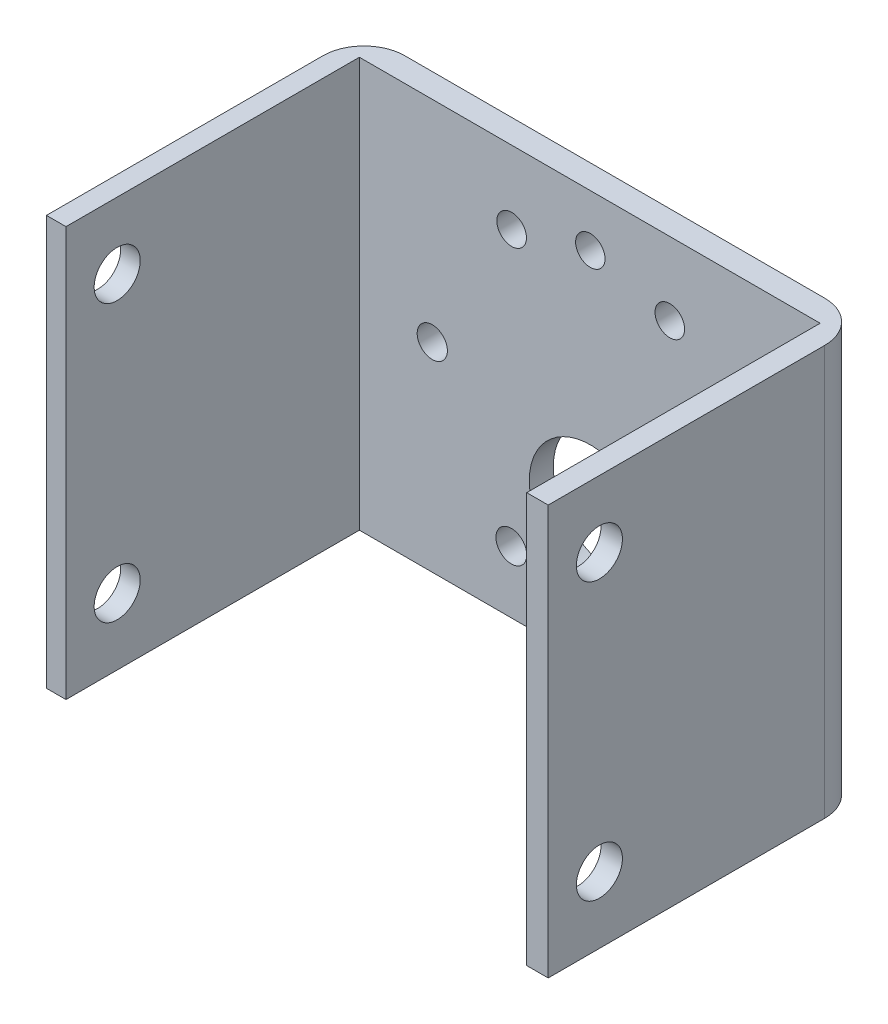
ISO-10303-21;
HEADER;
FILE_DESCRIPTION(('STEP AP214'),'2;1');
FILE_NAME('part.step','',(''),(''),'','','');
FILE_SCHEMA(('AUTOMOTIVE_DESIGN { 1 0 10303 214 1 1 1 1 }'));
ENDSEC;
DATA;
#1=APPLICATION_CONTEXT('core data for automotive mechanical design processes');
#2=APPLICATION_PROTOCOL_DEFINITION('international standard','automotive_design',2000,#1);
#3=PRODUCT_CONTEXT('',#1,'mechanical');
#4=PRODUCT('Part','Part','',(#3));
#5=PRODUCT_RELATED_PRODUCT_CATEGORY('part','',(#4));
#6=PRODUCT_DEFINITION_FORMATION('','',#4);
#7=PRODUCT_DEFINITION_CONTEXT('part definition',#1,'design');
#8=PRODUCT_DEFINITION('design','',#6,#7);
#9=PRODUCT_DEFINITION_SHAPE('','',#8);
#10=(LENGTH_UNIT() NAMED_UNIT(*) SI_UNIT(.MILLI.,.METRE.));
#11=(NAMED_UNIT(*) PLANE_ANGLE_UNIT() SI_UNIT($,.RADIAN.));
#12=(NAMED_UNIT(*) SI_UNIT($,.STERADIAN.) SOLID_ANGLE_UNIT());
#13=UNCERTAINTY_MEASURE_WITH_UNIT(LENGTH_MEASURE(1.E-05),#10,'distance_accuracy_value','');
#14=(GEOMETRIC_REPRESENTATION_CONTEXT(3) GLOBAL_UNCERTAINTY_ASSIGNED_CONTEXT((#13)) GLOBAL_UNIT_ASSIGNED_CONTEXT((#10,
#11,#12)) REPRESENTATION_CONTEXT('',''));
#15=CARTESIAN_POINT('',(0.,0.,0.));
#16=DIRECTION('',(0.,0.,1.));
#17=DIRECTION('',(1.,0.,0.));
#18=AXIS2_PLACEMENT_3D('',#15,#16,#17);
#19=CARTESIAN_POINT('',(22.2141703778084,40.,15.5));
#20=DIRECTION('',(0.,0.,-1.));
#21=DIRECTION('',(-1.,0.,0.));
#22=AXIS2_PLACEMENT_3D('',#19,#20,#21);
#23=PLANE('',#22);
#24=DIRECTION('',(1.,0.,0.));
#25=VECTOR('',#24,1.);
#26=CARTESIAN_POINT('',(22.2141703778084,40.,15.5));
#27=LINE('',#26,#25);
#28=CARTESIAN_POINT('',(22.4041703778084,40.,15.5));
#29=VERTEX_POINT('',#28);
#30=CARTESIAN_POINT('',(24.5,40.,15.5));
#31=VERTEX_POINT('',#30);
#32=EDGE_CURVE('E124',#29,#31,#27,.T.);
#33=ORIENTED_EDGE('',*,*,#32,.F.);
#34=DIRECTION('',(0.,-1.,0.));
#35=VECTOR('',#34,1.);
#36=CARTESIAN_POINT('',(22.4041703778084,463.,15.5));
#37=LINE('',#36,#35);
#38=CARTESIAN_POINT('',(22.4041703778084,0.,15.5));
#39=VERTEX_POINT('',#38);
#40=EDGE_CURVE('E134',#29,#39,#37,.T.);
#41=ORIENTED_EDGE('',*,*,#40,.T.);
#42=DIRECTION('',(1.,0.,0.));
#43=VECTOR('',#42,1.);
#44=CARTESIAN_POINT('',(22.2141703778084,0.,15.5));
#45=LINE('',#44,#43);
#46=CARTESIAN_POINT('',(24.5,0.,15.5));
#47=VERTEX_POINT('',#46);
#48=EDGE_CURVE('E139',#39,#47,#45,.T.);
#49=ORIENTED_EDGE('',*,*,#48,.T.);
#50=DIRECTION('',(0.,-1.,0.));
#51=VECTOR('',#50,1.);
#52=CARTESIAN_POINT('',(24.5,40.,15.5));
#53=LINE('',#52,#51);
#54=EDGE_CURVE('E202',#31,#47,#53,.T.);
#55=ORIENTED_EDGE('',*,*,#54,.F.);
#56=EDGE_LOOP('',(#33,#41,#49,#55));
#57=FACE_BOUND('',#56,.T.);
#58=ADVANCED_FACE('F35',(#57),#23,.F.);
#59=CARTESIAN_POINT('',(24.5,40.,-15.5));
#60=DIRECTION('',(-1.,0.,0.));
#61=DIRECTION('',(0.,0.,1.));
#62=AXIS2_PLACEMENT_3D('',#59,#60,#61);
#63=PLANE('',#62);
#64=CARTESIAN_POINT('',(24.5,6.5,10.5));
#65=DIRECTION('',(-1.,0.,0.));
#66=DIRECTION('',(0.,0.,1.));
#67=AXIS2_PLACEMENT_3D('',#64,#65,#66);
#68=CIRCLE('',#67,2.25);
#69=CARTESIAN_POINT('',(24.5,6.5,12.75));
#70=VERTEX_POINT('',#69);
#71=EDGE_CURVE('E172',#70,#70,#68,.T.);
#72=ORIENTED_EDGE('',*,*,#71,.T.);
#73=EDGE_LOOP('',(#72));
#74=FACE_BOUND('',#73,.T.);
#75=CARTESIAN_POINT('',(24.5,33.5,10.5));
#76=DIRECTION('',(-1.,0.,0.));
#77=DIRECTION('',(0.,0.,1.));
#78=AXIS2_PLACEMENT_3D('',#75,#76,#77);
#79=CIRCLE('',#78,2.25);
#80=CARTESIAN_POINT('',(24.5,33.5,12.75));
#81=VERTEX_POINT('',#80);
#82=EDGE_CURVE('E167',#81,#81,#79,.T.);
#83=ORIENTED_EDGE('',*,*,#82,.T.);
#84=EDGE_LOOP('',(#83));
#85=FACE_BOUND('',#84,.T.);
#86=DIRECTION('',(0.,0.,-1.));
#87=VECTOR('',#86,1.);
#88=CARTESIAN_POINT('',(24.5,0.,-15.5));
#89=LINE('',#88,#87);
#90=CARTESIAN_POINT('',(24.5,0.,-11.5));
#91=VERTEX_POINT('',#90);
#92=EDGE_CURVE('E190',#47,#91,#89,.T.);
#93=ORIENTED_EDGE('',*,*,#92,.T.);
#94=DIRECTION('',(0.,-1.,0.));
#95=VECTOR('',#94,1.);
#96=CARTESIAN_POINT('',(24.5,40.,-11.5));
#97=LINE('',#96,#95);
#98=CARTESIAN_POINT('',(24.5,40.,-11.5));
#99=VERTEX_POINT('',#98);
#100=EDGE_CURVE('E214',#91,#99,#97,.F.);
#101=ORIENTED_EDGE('',*,*,#100,.T.);
#102=DIRECTION('',(0.,0.,-1.));
#103=VECTOR('',#102,1.);
#104=CARTESIAN_POINT('',(24.5,40.,-15.5));
#105=LINE('',#104,#103);
#106=EDGE_CURVE('E176',#31,#99,#105,.T.);
#107=ORIENTED_EDGE('',*,*,#106,.F.);
#108=ORIENTED_EDGE('',*,*,#54,.T.);
#109=EDGE_LOOP('',(#93,#101,#107,#108));
#110=FACE_BOUND('',#109,.T.);
#111=ADVANCED_FACE('F259',(#74,#85,#110),#63,.F.);
#112=CARTESIAN_POINT('',(-24.5,40.,-15.5));
#113=DIRECTION('',(0.,0.,1.));
#114=DIRECTION('',(1.,0.,0.));
#115=AXIS2_PLACEMENT_3D('',#112,#113,#114);
#116=PLANE('',#115);
#117=CARTESIAN_POINT('',(-15.4751976460516,19.465354549289,-15.5));
#118=DIRECTION('',(0.,0.,-1.));
#119=DIRECTION('',(-1.,0.,0.));
#120=AXIS2_PLACEMENT_3D('',#117,#118,#119);
#121=CIRCLE('',#120,1.47560441927066);
#122=CARTESIAN_POINT('',(-16.9508020653222,19.465354549289,-15.5));
#123=VERTEX_POINT('',#122);
#124=EDGE_CURVE('E228',#123,#123,#121,.T.);
#125=ORIENTED_EDGE('',*,*,#124,.F.);
#126=EDGE_LOOP('',(#125));
#127=FACE_BOUND('',#126,.T.);
#128=CARTESIAN_POINT('',(-7.72259205509794,32.8759218055574,-15.5));
#129=DIRECTION('',(0.,0.,-1.));
#130=DIRECTION('',(-1.,0.,0.));
#131=AXIS2_PLACEMENT_3D('',#128,#129,#130);
#132=CIRCLE('',#131,1.44518411019594);
#133=CARTESIAN_POINT('',(-9.16777616529388,32.8759218055574,-15.5));
#134=VERTEX_POINT('',#133);
#135=EDGE_CURVE('E376',#134,#134,#132,.T.);
#136=ORIENTED_EDGE('',*,*,#135,.F.);
#137=EDGE_LOOP('',(#136));
#138=FACE_BOUND('',#137,.T.);
#139=CARTESIAN_POINT('',(7.72259205509795,32.8759218055574,-15.5));
#140=DIRECTION('',(0.,0.,-1.));
#141=DIRECTION('',(-1.,0.,0.));
#142=AXIS2_PLACEMENT_3D('',#139,#140,#141);
#143=CIRCLE('',#142,1.44518411019594);
#144=CARTESIAN_POINT('',(6.27740794490201,32.8759218055574,-15.5));
#145=VERTEX_POINT('',#144);
#146=EDGE_CURVE('E373',#145,#145,#143,.T.);
#147=ORIENTED_EDGE('',*,*,#146,.F.);
#148=EDGE_LOOP('',(#147));
#149=FACE_BOUND('',#148,.T.);
#150=CARTESIAN_POINT('',(7.7526009269815,6.07211293079628,-15.5));
#151=DIRECTION('',(0.,0.,-1.));
#152=DIRECTION('',(-1.,0.,0.));
#153=AXIS2_PLACEMENT_3D('',#150,#151,#152);
#154=CIRCLE('',#153,1.5);
#155=CARTESIAN_POINT('',(6.2526009269815,6.07211293079628,-15.5));
#156=VERTEX_POINT('',#155);
#157=EDGE_CURVE('E369',#156,#156,#154,.T.);
#158=ORIENTED_EDGE('',*,*,#157,.F.);
#159=EDGE_LOOP('',(#158));
#160=FACE_BOUND('',#159,.T.);
#161=CARTESIAN_POINT('',(15.4751976460516,19.465354549289,-15.5));
#162=DIRECTION('',(0.,0.,-1.));
#163=DIRECTION('',(-1.,0.,0.));
#164=AXIS2_PLACEMENT_3D('',#161,#162,#163);
#165=CIRCLE('',#164,1.46320376411556);
#166=CARTESIAN_POINT('',(14.011993881936,19.465354549289,-15.5));
#167=VERTEX_POINT('',#166);
#168=EDGE_CURVE('E363',#167,#167,#165,.T.);
#169=ORIENTED_EDGE('',*,*,#168,.F.);
#170=EDGE_LOOP('',(#169));
#171=FACE_BOUND('',#170,.T.);
#172=CARTESIAN_POINT('',(0.,3.99015690323744,-15.5));
#173=DIRECTION('',(0.,0.,-1.));
#174=DIRECTION('',(-1.,0.,0.));
#175=AXIS2_PLACEMENT_3D('',#172,#173,#174);
#176=CIRCLE('',#175,1.5);
#177=CARTESIAN_POINT('',(-1.49999999999999,3.99015690323744,-15.5));
#178=VERTEX_POINT('',#177);
#179=EDGE_CURVE('E366',#178,#178,#176,.T.);
#180=ORIENTED_EDGE('',*,*,#179,.F.);
#181=EDGE_LOOP('',(#180));
#182=FACE_BOUND('',#181,.T.);
#183=CARTESIAN_POINT('',(-0.0421418164080409,34.9349375124211,-15.5));
#184=DIRECTION('',(0.,0.,-1.));
#185=DIRECTION('',(-1.,0.,0.));
#186=AXIS2_PLACEMENT_3D('',#183,#184,#185);
#187=CIRCLE('',#186,1.43493751242113);
#188=CARTESIAN_POINT('',(-1.47707932882917,34.9349375124211,-15.5));
#189=VERTEX_POINT('',#188);
#190=EDGE_CURVE('E379',#189,#189,#187,.T.);
#191=ORIENTED_EDGE('',*,*,#190,.F.);
#192=EDGE_LOOP('',(#191));
#193=FACE_BOUND('',#192,.T.);
#194=CARTESIAN_POINT('',(-7.75259589553919,6.07211001837609,-15.5));
#195=DIRECTION('',(0.,0.,-1.));
#196=DIRECTION('',(-1.,0.,0.));
#197=AXIS2_PLACEMENT_3D('',#194,#195,#196);
#198=CIRCLE('',#197,1.50519179107846);
#199=CARTESIAN_POINT('',(-9.25778768661766,6.07211001837609,-15.5));
#200=VERTEX_POINT('',#199);
#201=EDGE_CURVE('E372',#200,#200,#198,.T.);
#202=ORIENTED_EDGE('',*,*,#201,.F.);
#203=EDGE_LOOP('',(#202));
#204=FACE_BOUND('',#203,.T.);
#205=CARTESIAN_POINT('',(0.,12.5,-15.5));
#206=DIRECTION('',(0.,0.,-1.));
#207=DIRECTION('',(-1.,0.,0.));
#208=AXIS2_PLACEMENT_3D('',#205,#206,#207);
#209=CIRCLE('',#208,6.);
#210=CARTESIAN_POINT('',(-6.,12.5,-15.5));
#211=VERTEX_POINT('',#210);
#212=EDGE_CURVE('E144',#211,#211,#209,.T.);
#213=ORIENTED_EDGE('',*,*,#212,.F.);
#214=EDGE_LOOP('',(#213));
#215=FACE_BOUND('',#214,.T.);
#216=DIRECTION('',(-1.,0.,0.));
#217=VECTOR('',#216,1.);
#218=CARTESIAN_POINT('',(-24.5,40.,-15.5));
#219=LINE('',#218,#217);
#220=CARTESIAN_POINT('',(20.5,40.,-15.5));
#221=VERTEX_POINT('',#220);
#222=CARTESIAN_POINT('',(-20.5,40.,-15.5));
#223=VERTEX_POINT('',#222);
#224=EDGE_CURVE('E179',#221,#223,#219,.T.);
#225=ORIENTED_EDGE('',*,*,#224,.F.);
#226=DIRECTION('',(0.,-1.,0.));
#227=VECTOR('',#226,1.);
#228=CARTESIAN_POINT('',(20.5,40.,-15.5));
#229=LINE('',#228,#227);
#230=CARTESIAN_POINT('',(20.5,0.,-15.5));
#231=VERTEX_POINT('',#230);
#232=EDGE_CURVE('E207',#221,#231,#229,.T.);
#233=ORIENTED_EDGE('',*,*,#232,.T.);
#234=DIRECTION('',(-1.,0.,0.));
#235=VECTOR('',#234,1.);
#236=CARTESIAN_POINT('',(-24.5,0.,-15.5));
#237=LINE('',#236,#235);
#238=CARTESIAN_POINT('',(-20.5,0.,-15.5));
#239=VERTEX_POINT('',#238);
#240=EDGE_CURVE('E193',#231,#239,#237,.T.);
#241=ORIENTED_EDGE('',*,*,#240,.T.);
#242=DIRECTION('',(0.,-1.,0.));
#243=VECTOR('',#242,1.);
#244=CARTESIAN_POINT('',(-20.5,40.,-15.5));
#245=LINE('',#244,#243);
#246=EDGE_CURVE('E205',#239,#223,#245,.F.);
#247=ORIENTED_EDGE('',*,*,#246,.T.);
#248=EDGE_LOOP('',(#225,#233,#241,#247));
#249=FACE_BOUND('',#248,.T.);
#250=ADVANCED_FACE('F255',(#127,#138,#149,#160,#171,#182,#193,#204,#215,#249),#116,.F.);
#251=CARTESIAN_POINT('',(-24.5,40.,-15.5));
#252=DIRECTION('',(1.,0.,0.));
#253=DIRECTION('',(0.,0.,-1.));
#254=AXIS2_PLACEMENT_3D('',#251,#252,#253);
#255=PLANE('',#254);
#256=CARTESIAN_POINT('',(-24.5,6.5,10.5));
#257=DIRECTION('',(-1.,0.,0.));
#258=DIRECTION('',(0.,0.,1.));
#259=AXIS2_PLACEMENT_3D('',#256,#257,#258);
#260=CIRCLE('',#259,2.25);
#261=CARTESIAN_POINT('',(-24.5,6.5,12.75));
#262=VERTEX_POINT('',#261);
#263=EDGE_CURVE('E164',#262,#262,#260,.T.);
#264=ORIENTED_EDGE('',*,*,#263,.F.);
#265=EDGE_LOOP('',(#264));
#266=FACE_BOUND('',#265,.T.);
#267=CARTESIAN_POINT('',(-24.5,33.5,10.5));
#268=DIRECTION('',(-1.,0.,0.));
#269=DIRECTION('',(0.,0.,1.));
#270=AXIS2_PLACEMENT_3D('',#267,#268,#269);
#271=CIRCLE('',#270,2.25);
#272=CARTESIAN_POINT('',(-24.5,33.5,12.75));
#273=VERTEX_POINT('',#272);
#274=EDGE_CURVE('E163',#273,#273,#271,.T.);
#275=ORIENTED_EDGE('',*,*,#274,.F.);
#276=EDGE_LOOP('',(#275));
#277=FACE_BOUND('',#276,.T.);
#278=DIRECTION('',(0.,0.,1.));
#279=VECTOR('',#278,1.);
#280=CARTESIAN_POINT('',(-24.5,40.,-15.5));
#281=LINE('',#280,#279);
#282=CARTESIAN_POINT('',(-24.5,40.,-11.5));
#283=VERTEX_POINT('',#282);
#284=CARTESIAN_POINT('',(-24.5,40.,15.5));
#285=VERTEX_POINT('',#284);
#286=EDGE_CURVE('E181',#283,#285,#281,.T.);
#287=ORIENTED_EDGE('',*,*,#286,.F.);
#288=DIRECTION('',(0.,-1.,0.));
#289=VECTOR('',#288,1.);
#290=CARTESIAN_POINT('',(-24.5,40.,-11.5));
#291=LINE('',#290,#289);
#292=CARTESIAN_POINT('',(-24.5,0.,-11.5));
#293=VERTEX_POINT('',#292);
#294=EDGE_CURVE('E11',#283,#293,#291,.T.);
#295=ORIENTED_EDGE('',*,*,#294,.T.);
#296=DIRECTION('',(0.,0.,1.));
#297=VECTOR('',#296,1.);
#298=CARTESIAN_POINT('',(-24.5,0.,-15.5));
#299=LINE('',#298,#297);
#300=CARTESIAN_POINT('',(-24.5,0.,15.5));
#301=VERTEX_POINT('',#300);
#302=EDGE_CURVE('E196',#293,#301,#299,.T.);
#303=ORIENTED_EDGE('',*,*,#302,.T.);
#304=DIRECTION('',(0.,-1.,0.));
#305=VECTOR('',#304,1.);
#306=CARTESIAN_POINT('',(-24.5,40.,15.5));
#307=LINE('',#306,#305);
#308=EDGE_CURVE('E188',#285,#301,#307,.T.);
#309=ORIENTED_EDGE('',*,*,#308,.F.);
#310=EDGE_LOOP('',(#287,#295,#303,#309));
#311=FACE_BOUND('',#310,.T.);
#312=ADVANCED_FACE('F258',(#266,#277,#311),#255,.F.);
#313=CARTESIAN_POINT('',(-24.5,40.,15.5));
#314=DIRECTION('',(0.,0.,-1.));
#315=DIRECTION('',(-1.,0.,0.));
#316=AXIS2_PLACEMENT_3D('',#313,#314,#315);
#317=PLANE('',#316);
#318=DIRECTION('',(1.,0.,0.));
#319=VECTOR('',#318,1.);
#320=CARTESIAN_POINT('',(-24.5,0.,15.5));
#321=LINE('',#320,#319);
#322=CARTESIAN_POINT('',(-22.5933043978458,0.,15.5));
#323=VERTEX_POINT('',#322);
#324=EDGE_CURVE('E125',#301,#323,#321,.T.);
#325=ORIENTED_EDGE('',*,*,#324,.T.);
#326=DIRECTION('',(0.,-1.,0.));
#327=VECTOR('',#326,1.);
#328=CARTESIAN_POINT('',(-22.5933043978458,463.,15.5));
#329=LINE('',#328,#327);
#330=CARTESIAN_POINT('',(-22.5933043978458,40.,15.5));
#331=VERTEX_POINT('',#330);
#332=EDGE_CURVE('E52',#331,#323,#329,.T.);
#333=ORIENTED_EDGE('',*,*,#332,.F.);
#334=DIRECTION('',(1.,0.,0.));
#335=VECTOR('',#334,1.);
#336=CARTESIAN_POINT('',(-24.5,40.,15.5));
#337=LINE('',#336,#335);
#338=EDGE_CURVE('E183',#285,#331,#337,.T.);
#339=ORIENTED_EDGE('',*,*,#338,.F.);
#340=ORIENTED_EDGE('',*,*,#308,.T.);
#341=EDGE_LOOP('',(#325,#333,#339,#340));
#342=FACE_BOUND('',#341,.T.);
#343=ADVANCED_FACE('F280',(#342),#317,.F.);
#344=CARTESIAN_POINT('',(-22.4033043978458,40.,-13.1532472954369));
#345=DIRECTION('',(0.,0.,-1.));
#346=DIRECTION('',(-1.,0.,0.));
#347=AXIS2_PLACEMENT_3D('',#344,#345,#346);
#348=PLANE('',#347);
#349=CARTESIAN_POINT('',(-15.4751976460516,19.465354549289,-13.1532472954369));
#350=DIRECTION('',(0.,0.,-1.));
#351=DIRECTION('',(-1.,0.,0.));
#352=AXIS2_PLACEMENT_3D('',#349,#350,#351);
#353=CIRCLE('',#352,1.47560441927066);
#354=CARTESIAN_POINT('',(-16.9508020653222,19.465354549289,-13.1532472954369));
#355=VERTEX_POINT('',#354);
#356=EDGE_CURVE('E39',#355,#355,#353,.T.);
#357=ORIENTED_EDGE('',*,*,#356,.T.);
#358=EDGE_LOOP('',(#357));
#359=FACE_BOUND('',#358,.T.);
#360=CARTESIAN_POINT('',(-7.72259205509794,32.8759218055574,-13.1532472954369));
#361=DIRECTION('',(0.,0.,-1.));
#362=DIRECTION('',(-1.,0.,0.));
#363=AXIS2_PLACEMENT_3D('',#360,#361,#362);
#364=CIRCLE('',#363,1.44518411019594);
#365=CARTESIAN_POINT('',(-9.16777616529388,32.8759218055574,-13.1532472954369));
#366=VERTEX_POINT('',#365);
#367=EDGE_CURVE('E242',#366,#366,#364,.T.);
#368=ORIENTED_EDGE('',*,*,#367,.T.);
#369=EDGE_LOOP('',(#368));
#370=FACE_BOUND('',#369,.T.);
#371=CARTESIAN_POINT('',(7.72259205509795,32.8759218055574,-13.1532472954369));
#372=DIRECTION('',(0.,0.,-1.));
#373=DIRECTION('',(-1.,0.,0.));
#374=AXIS2_PLACEMENT_3D('',#371,#372,#373);
#375=CIRCLE('',#374,1.44518411019594);
#376=CARTESIAN_POINT('',(6.27740794490201,32.8759218055574,-13.1532472954369));
#377=VERTEX_POINT('',#376);
#378=EDGE_CURVE('E240',#377,#377,#375,.T.);
#379=ORIENTED_EDGE('',*,*,#378,.T.);
#380=EDGE_LOOP('',(#379));
#381=FACE_BOUND('',#380,.T.);
#382=CARTESIAN_POINT('',(7.7526009269815,6.07211293079628,-13.1532472954369));
#383=DIRECTION('',(0.,0.,-1.));
#384=DIRECTION('',(-1.,0.,0.));
#385=AXIS2_PLACEMENT_3D('',#382,#383,#384);
#386=CIRCLE('',#385,1.5);
#387=CARTESIAN_POINT('',(6.2526009269815,6.07211293079628,-13.1532472954369));
#388=VERTEX_POINT('',#387);
#389=EDGE_CURVE('E237',#388,#388,#386,.T.);
#390=ORIENTED_EDGE('',*,*,#389,.T.);
#391=EDGE_LOOP('',(#390));
#392=FACE_BOUND('',#391,.T.);
#393=CARTESIAN_POINT('',(15.4751976460516,19.465354549289,-13.1532472954369));
#394=DIRECTION('',(0.,0.,-1.));
#395=DIRECTION('',(-1.,0.,0.));
#396=AXIS2_PLACEMENT_3D('',#393,#394,#395);
#397=CIRCLE('',#396,1.46320376411556);
#398=CARTESIAN_POINT('',(14.011993881936,19.465354549289,-13.1532472954369));
#399=VERTEX_POINT('',#398);
#400=EDGE_CURVE('E234',#399,#399,#397,.T.);
#401=ORIENTED_EDGE('',*,*,#400,.T.);
#402=EDGE_LOOP('',(#401));
#403=FACE_BOUND('',#402,.T.);
#404=CARTESIAN_POINT('',(0.,3.99015690323744,-13.1532472954369));
#405=DIRECTION('',(0.,0.,-1.));
#406=DIRECTION('',(-1.,0.,0.));
#407=AXIS2_PLACEMENT_3D('',#404,#405,#406);
#408=CIRCLE('',#407,1.5);
#409=CARTESIAN_POINT('',(-1.49999999999999,3.99015690323744,-13.1532472954369));
#410=VERTEX_POINT('',#409);
#411=EDGE_CURVE('E231',#410,#410,#408,.T.);
#412=ORIENTED_EDGE('',*,*,#411,.T.);
#413=EDGE_LOOP('',(#412));
#414=FACE_BOUND('',#413,.T.);
#415=CARTESIAN_POINT('',(-0.0421418164080409,34.9349375124211,-13.1532472954369));
#416=DIRECTION('',(0.,0.,-1.));
#417=DIRECTION('',(-1.,0.,0.));
#418=AXIS2_PLACEMENT_3D('',#415,#416,#417);
#419=CIRCLE('',#418,1.43493751242113);
#420=CARTESIAN_POINT('',(-1.47707932882917,34.9349375124211,-13.1532472954369));
#421=VERTEX_POINT('',#420);
#422=EDGE_CURVE('E227',#421,#421,#419,.T.);
#423=ORIENTED_EDGE('',*,*,#422,.T.);
#424=EDGE_LOOP('',(#423));
#425=FACE_BOUND('',#424,.T.);
#426=CARTESIAN_POINT('',(-7.75259589553919,6.07211001837609,-13.1532472954369));
#427=DIRECTION('',(0.,0.,-1.));
#428=DIRECTION('',(-1.,0.,0.));
#429=AXIS2_PLACEMENT_3D('',#426,#427,#428);
#430=CIRCLE('',#429,1.50519179107846);
#431=CARTESIAN_POINT('',(-9.25778768661766,6.07211001837609,-13.1532472954369));
#432=VERTEX_POINT('',#431);
#433=EDGE_CURVE('E224',#432,#432,#430,.T.);
#434=ORIENTED_EDGE('',*,*,#433,.T.);
#435=EDGE_LOOP('',(#434));
#436=FACE_BOUND('',#435,.T.);
#437=CARTESIAN_POINT('',(0.,12.5,-13.1532472954369));
#438=DIRECTION('',(0.,0.,-1.));
#439=DIRECTION('',(-1.,0.,0.));
#440=AXIS2_PLACEMENT_3D('',#437,#438,#439);
#441=CIRCLE('',#440,6.);
#442=CARTESIAN_POINT('',(-6.,12.5,-13.1532472954369));
#443=VERTEX_POINT('',#442);
#444=EDGE_CURVE('E149',#443,#443,#441,.T.);
#445=ORIENTED_EDGE('',*,*,#444,.T.);
#446=EDGE_LOOP('',(#445));
#447=FACE_BOUND('',#446,.T.);
#448=DIRECTION('',(1.,0.,0.));
#449=VECTOR('',#448,1.);
#450=CARTESIAN_POINT('',(-22.4033043978458,0.,-13.1532472954369));
#451=LINE('',#450,#449);
#452=CARTESIAN_POINT('',(-22.5933043978458,0.,-13.1532472954369));
#453=VERTEX_POINT('',#452);
#454=CARTESIAN_POINT('',(22.4041703778084,0.,-13.1532472954369));
#455=VERTEX_POINT('',#454);
#456=EDGE_CURVE('E116',#453,#455,#451,.T.);
#457=ORIENTED_EDGE('',*,*,#456,.T.);
#458=DIRECTION('',(0.,-1.,0.));
#459=VECTOR('',#458,1.);
#460=CARTESIAN_POINT('',(22.4041703778084,463.,-13.1532472954369));
#461=LINE('',#460,#459);
#462=CARTESIAN_POINT('',(22.4041703778084,40.,-13.1532472954369));
#463=VERTEX_POINT('',#462);
#464=EDGE_CURVE('E119',#463,#455,#461,.T.);
#465=ORIENTED_EDGE('',*,*,#464,.F.);
#466=DIRECTION('',(1.,0.,0.));
#467=VECTOR('',#466,1.);
#468=CARTESIAN_POINT('',(-22.4033043978458,40.,-13.1532472954369));
#469=LINE('',#468,#467);
#470=CARTESIAN_POINT('',(-22.5933043978458,40.,-13.1532472954369));
#471=VERTEX_POINT('',#470);
#472=EDGE_CURVE('E186',#471,#463,#469,.T.);
#473=ORIENTED_EDGE('',*,*,#472,.F.);
#474=DIRECTION('',(0.,-1.,0.));
#475=VECTOR('',#474,1.);
#476=CARTESIAN_POINT('',(-22.5933043978458,463.,-13.1532472954369));
#477=LINE('',#476,#475);
#478=EDGE_CURVE('E121',#471,#453,#477,.T.);
#479=ORIENTED_EDGE('',*,*,#478,.T.);
#480=EDGE_LOOP('',(#457,#465,#473,#479));
#481=FACE_BOUND('',#480,.T.);
#482=ADVANCED_FACE('F118',(#359,#370,#381,#392,#403,#414,#425,#436,#447,#481),#348,.F.);
#483=CARTESIAN_POINT('',(0.,40.,0.));
#484=DIRECTION('',(0.,-1.,0.));
#485=DIRECTION('',(0.,0.,-1.));
#486=AXIS2_PLACEMENT_3D('',#483,#484,#485);
#487=PLANE('',#486);
#488=ORIENTED_EDGE('',*,*,#472,.T.);
#489=DIRECTION('',(0.,0.,1.));
#490=VECTOR('',#489,1.);
#491=CARTESIAN_POINT('',(22.4041703778084,40.,0.));
#492=LINE('',#491,#490);
#493=EDGE_CURVE('E133',#463,#29,#492,.T.);
#494=ORIENTED_EDGE('',*,*,#493,.T.);
#495=ORIENTED_EDGE('',*,*,#32,.T.);
#496=ORIENTED_EDGE('',*,*,#106,.T.);
#497=CARTESIAN_POINT('',(20.5,40.,-11.5));
#498=DIRECTION('',(0.,-1.,0.));
#499=DIRECTION('',(0.,0.,-1.));
#500=AXIS2_PLACEMENT_3D('',#497,#498,#499);
#501=CIRCLE('',#500,4.);
#502=EDGE_CURVE('E44',#99,#221,#501,.F.);
#503=ORIENTED_EDGE('',*,*,#502,.T.);
#504=ORIENTED_EDGE('',*,*,#224,.T.);
#505=CARTESIAN_POINT('',(-20.5,40.,-11.5));
#506=DIRECTION('',(0.,-1.,0.));
#507=DIRECTION('',(0.,0.,-1.));
#508=AXIS2_PLACEMENT_3D('',#505,#506,#507);
#509=CIRCLE('',#508,4.);
#510=EDGE_CURVE('E60',#223,#283,#509,.F.);
#511=ORIENTED_EDGE('',*,*,#510,.T.);
#512=ORIENTED_EDGE('',*,*,#286,.T.);
#513=ORIENTED_EDGE('',*,*,#338,.T.);
#514=DIRECTION('',(0.,0.,-1.));
#515=VECTOR('',#514,1.);
#516=CARTESIAN_POINT('',(-22.5933043978458,40.,0.));
#517=LINE('',#516,#515);
#518=EDGE_CURVE('E155',#331,#471,#517,.T.);
#519=ORIENTED_EDGE('',*,*,#518,.T.);
#520=EDGE_LOOP('',(#488,#494,#495,#496,#503,#504,#511,#512,#513,#519));
#521=FACE_BOUND('',#520,.T.);
#522=ADVANCED_FACE('F275',(#521),#487,.F.);
#523=CARTESIAN_POINT('',(0.,0.,0.));
#524=DIRECTION('',(0.,-1.,0.));
#525=DIRECTION('',(0.,0.,-1.));
#526=AXIS2_PLACEMENT_3D('',#523,#524,#525);
#527=PLANE('',#526);
#528=DIRECTION('',(0.,0.,1.));
#529=VECTOR('',#528,1.);
#530=CARTESIAN_POINT('',(22.4041703778084,0.,-13.1532472954369));
#531=LINE('',#530,#529);
#532=EDGE_CURVE('E130',#455,#39,#531,.T.);
#533=ORIENTED_EDGE('',*,*,#532,.F.);
#534=ORIENTED_EDGE('',*,*,#456,.F.);
#535=DIRECTION('',(0.,0.,-1.));
#536=VECTOR('',#535,1.);
#537=CARTESIAN_POINT('',(-22.5933043978458,0.,-13.1532472954369));
#538=LINE('',#537,#536);
#539=EDGE_CURVE('E148',#323,#453,#538,.T.);
#540=ORIENTED_EDGE('',*,*,#539,.F.);
#541=ORIENTED_EDGE('',*,*,#324,.F.);
#542=ORIENTED_EDGE('',*,*,#302,.F.);
#543=CARTESIAN_POINT('',(-20.5,0.,-11.5));
#544=DIRECTION('',(0.,-1.,0.));
#545=DIRECTION('',(0.,0.,-1.));
#546=AXIS2_PLACEMENT_3D('',#543,#544,#545);
#547=CIRCLE('',#546,4.);
#548=EDGE_CURVE('E210',#293,#239,#547,.T.);
#549=ORIENTED_EDGE('',*,*,#548,.T.);
#550=ORIENTED_EDGE('',*,*,#240,.F.);
#551=CARTESIAN_POINT('',(20.5,0.,-11.5));
#552=DIRECTION('',(0.,-1.,0.));
#553=DIRECTION('',(0.,0.,-1.));
#554=AXIS2_PLACEMENT_3D('',#551,#552,#553);
#555=CIRCLE('',#554,4.);
#556=EDGE_CURVE('E212',#231,#91,#555,.T.);
#557=ORIENTED_EDGE('',*,*,#556,.T.);
#558=ORIENTED_EDGE('',*,*,#92,.F.);
#559=ORIENTED_EDGE('',*,*,#48,.F.);
#560=EDGE_LOOP('',(#533,#534,#540,#541,#542,#549,#550,#557,#558,#559));
#561=FACE_BOUND('',#560,.T.);
#562=ADVANCED_FACE('F137',(#561),#527,.T.);
#563=CARTESIAN_POINT('',(20.5,40.,-11.5));
#564=DIRECTION('',(0.,-1.,0.));
#565=DIRECTION('',(0.,0.,-1.));
#566=AXIS2_PLACEMENT_3D('',#563,#564,#565);
#567=CYLINDRICAL_SURFACE('',#566,4.);
#568=ORIENTED_EDGE('',*,*,#502,.F.);
#569=ORIENTED_EDGE('',*,*,#100,.F.);
#570=ORIENTED_EDGE('',*,*,#556,.F.);
#571=ORIENTED_EDGE('',*,*,#232,.F.);
#572=EDGE_LOOP('',(#568,#569,#570,#571));
#573=FACE_BOUND('',#572,.T.);
#574=ADVANCED_FACE('F268',(#573),#567,.T.);
#575=CARTESIAN_POINT('',(-20.5,40.,-11.5));
#576=DIRECTION('',(0.,-1.,0.));
#577=DIRECTION('',(0.,0.,-1.));
#578=AXIS2_PLACEMENT_3D('',#575,#576,#577);
#579=CYLINDRICAL_SURFACE('',#578,4.);
#580=ORIENTED_EDGE('',*,*,#510,.F.);
#581=ORIENTED_EDGE('',*,*,#246,.F.);
#582=ORIENTED_EDGE('',*,*,#548,.F.);
#583=ORIENTED_EDGE('',*,*,#294,.F.);
#584=EDGE_LOOP('',(#580,#581,#582,#583));
#585=FACE_BOUND('',#584,.T.);
#586=ADVANCED_FACE('F37',(#585),#579,.T.);
#587=CARTESIAN_POINT('',(51.5,33.5,10.5));
#588=DIRECTION('',(-1.,0.,0.));
#589=DIRECTION('',(0.,0.,1.));
#590=AXIS2_PLACEMENT_3D('',#587,#588,#589);
#591=CYLINDRICAL_SURFACE('',#590,2.25);
#592=CARTESIAN_POINT('',(22.4041703778084,33.5,10.5));
#593=DIRECTION('',(1.,0.,0.));
#594=DIRECTION('',(0.,0.,-1.));
#595=AXIS2_PLACEMENT_3D('',#592,#593,#594);
#596=CIRCLE('',#595,2.25);
#597=CARTESIAN_POINT('',(22.4041703778084,33.5,8.24999999999999));
#598=VERTEX_POINT('',#597);
#599=EDGE_CURVE('E159',#598,#598,#596,.F.);
#600=ORIENTED_EDGE('',*,*,#599,.T.);
#601=EDGE_LOOP('',(#600));
#602=FACE_BOUND('',#601,.T.);
#603=ORIENTED_EDGE('',*,*,#82,.F.);
#604=EDGE_LOOP('',(#603));
#605=FACE_BOUND('',#604,.T.);
#606=ADVANCED_FACE('F287',(#602,#605),#591,.F.);
#607=CARTESIAN_POINT('',(51.5,6.5,10.5));
#608=DIRECTION('',(-1.,0.,0.));
#609=DIRECTION('',(0.,0.,1.));
#610=AXIS2_PLACEMENT_3D('',#607,#608,#609);
#611=CYLINDRICAL_SURFACE('',#610,2.25);
#612=CARTESIAN_POINT('',(22.4041703778084,6.5,10.5));
#613=DIRECTION('',(1.,0.,0.));
#614=DIRECTION('',(0.,0.,-1.));
#615=AXIS2_PLACEMENT_3D('',#612,#613,#614);
#616=CIRCLE('',#615,2.25);
#617=CARTESIAN_POINT('',(22.4041703778084,6.5,8.25));
#618=VERTEX_POINT('',#617);
#619=EDGE_CURVE('E158',#618,#618,#616,.F.);
#620=ORIENTED_EDGE('',*,*,#619,.T.);
#621=EDGE_LOOP('',(#620));
#622=FACE_BOUND('',#621,.T.);
#623=ORIENTED_EDGE('',*,*,#71,.F.);
#624=EDGE_LOOP('',(#623));
#625=FACE_BOUND('',#624,.T.);
#626=ADVANCED_FACE('F292',(#622,#625),#611,.F.);
#627=CARTESIAN_POINT('',(-22.5933043978458,33.5,10.5));
#628=DIRECTION('',(-1.,0.,0.));
#629=DIRECTION('',(0.,0.,1.));
#630=AXIS2_PLACEMENT_3D('',#627,#628,#629);
#631=CIRCLE('',#630,2.25);
#632=CARTESIAN_POINT('',(-22.5933043978458,33.5,12.75));
#633=VERTEX_POINT('',#632);
#634=EDGE_CURVE('E152',#633,#633,#631,.F.);
#635=ORIENTED_EDGE('',*,*,#634,.T.);
#636=EDGE_LOOP('',(#635));
#637=FACE_BOUND('',#636,.T.);
#638=ORIENTED_EDGE('',*,*,#274,.T.);
#639=EDGE_LOOP('',(#638));
#640=FACE_BOUND('',#639,.T.);
#641=ADVANCED_FACE('F295',(#637,#640),#591,.F.);
#642=CARTESIAN_POINT('',(-22.5933043978458,6.5,10.5));
#643=DIRECTION('',(-1.,0.,0.));
#644=DIRECTION('',(0.,0.,1.));
#645=AXIS2_PLACEMENT_3D('',#642,#643,#644);
#646=CIRCLE('',#645,2.25);
#647=CARTESIAN_POINT('',(-22.5933043978458,6.5,12.75));
#648=VERTEX_POINT('',#647);
#649=EDGE_CURVE('E146',#648,#648,#646,.F.);
#650=ORIENTED_EDGE('',*,*,#649,.T.);
#651=EDGE_LOOP('',(#650));
#652=FACE_BOUND('',#651,.T.);
#653=ORIENTED_EDGE('',*,*,#263,.T.);
#654=EDGE_LOOP('',(#653));
#655=FACE_BOUND('',#654,.T.);
#656=ADVANCED_FACE('F318',(#652,#655),#611,.F.);
#657=CARTESIAN_POINT('',(-22.5933043978458,463.,-13.1532472954369));
#658=DIRECTION('',(-1.,0.,0.));
#659=DIRECTION('',(0.,0.,1.));
#660=AXIS2_PLACEMENT_3D('',#657,#658,#659);
#661=PLANE('',#660);
#662=ORIENTED_EDGE('',*,*,#649,.F.);
#663=EDGE_LOOP('',(#662));
#664=FACE_BOUND('',#663,.T.);
#665=ORIENTED_EDGE('',*,*,#634,.F.);
#666=EDGE_LOOP('',(#665));
#667=FACE_BOUND('',#666,.T.);
#668=ORIENTED_EDGE('',*,*,#332,.T.);
#669=ORIENTED_EDGE('',*,*,#539,.T.);
#670=ORIENTED_EDGE('',*,*,#478,.F.);
#671=ORIENTED_EDGE('',*,*,#518,.F.);
#672=EDGE_LOOP('',(#668,#669,#670,#671));
#673=FACE_BOUND('',#672,.T.);
#674=ADVANCED_FACE('F276',(#664,#667,#673),#661,.F.);
#675=CARTESIAN_POINT('',(22.4041703778084,463.,-13.1532472954369));
#676=DIRECTION('',(1.,0.,0.));
#677=DIRECTION('',(0.,0.,-1.));
#678=AXIS2_PLACEMENT_3D('',#675,#676,#677);
#679=PLANE('',#678);
#680=ORIENTED_EDGE('',*,*,#619,.F.);
#681=EDGE_LOOP('',(#680));
#682=FACE_BOUND('',#681,.T.);
#683=ORIENTED_EDGE('',*,*,#599,.F.);
#684=EDGE_LOOP('',(#683));
#685=FACE_BOUND('',#684,.T.);
#686=ORIENTED_EDGE('',*,*,#464,.T.);
#687=ORIENTED_EDGE('',*,*,#532,.T.);
#688=ORIENTED_EDGE('',*,*,#40,.F.);
#689=ORIENTED_EDGE('',*,*,#493,.F.);
#690=EDGE_LOOP('',(#686,#687,#688,#689));
#691=FACE_BOUND('',#690,.T.);
#692=ADVANCED_FACE('F129',(#682,#685,#691),#679,.F.);
#693=CARTESIAN_POINT('',(0.,12.5,-5.5));
#694=DIRECTION('',(0.,0.,-1.));
#695=DIRECTION('',(-1.,0.,0.));
#696=AXIS2_PLACEMENT_3D('',#693,#694,#695);
#697=CYLINDRICAL_SURFACE('',#696,6.);
#698=ORIENTED_EDGE('',*,*,#212,.T.);
#699=EDGE_LOOP('',(#698));
#700=FACE_BOUND('',#699,.T.);
#701=ORIENTED_EDGE('',*,*,#444,.F.);
#702=EDGE_LOOP('',(#701));
#703=FACE_BOUND('',#702,.T.);
#704=ADVANCED_FACE('F252',(#700,#703),#697,.F.);
#705=CARTESIAN_POINT('',(-7.75259589553919,6.07211001837609,-5.5));
#706=DIRECTION('',(0.,0.,-1.));
#707=DIRECTION('',(-1.,0.,0.));
#708=AXIS2_PLACEMENT_3D('',#705,#706,#707);
#709=CYLINDRICAL_SURFACE('',#708,1.50519179107846);
#710=ORIENTED_EDGE('',*,*,#201,.T.);
#711=EDGE_LOOP('',(#710));
#712=FACE_BOUND('',#711,.T.);
#713=ORIENTED_EDGE('',*,*,#433,.F.);
#714=EDGE_LOOP('',(#713));
#715=FACE_BOUND('',#714,.T.);
#716=ADVANCED_FACE('F327',(#712,#715),#709,.F.);
#717=CARTESIAN_POINT('',(-0.0421418164080409,34.9349375124211,-5.5));
#718=DIRECTION('',(0.,0.,-1.));
#719=DIRECTION('',(-1.,0.,0.));
#720=AXIS2_PLACEMENT_3D('',#717,#718,#719);
#721=CYLINDRICAL_SURFACE('',#720,1.43493751242113);
#722=ORIENTED_EDGE('',*,*,#190,.T.);
#723=EDGE_LOOP('',(#722));
#724=FACE_BOUND('',#723,.T.);
#725=ORIENTED_EDGE('',*,*,#422,.F.);
#726=EDGE_LOOP('',(#725));
#727=FACE_BOUND('',#726,.T.);
#728=ADVANCED_FACE('F332',(#724,#727),#721,.F.);
#729=CARTESIAN_POINT('',(0.,3.99015690323744,-5.5));
#730=DIRECTION('',(0.,0.,-1.));
#731=DIRECTION('',(-1.,0.,0.));
#732=AXIS2_PLACEMENT_3D('',#729,#730,#731);
#733=CYLINDRICAL_SURFACE('',#732,1.5);
#734=ORIENTED_EDGE('',*,*,#179,.T.);
#735=EDGE_LOOP('',(#734));
#736=FACE_BOUND('',#735,.T.);
#737=ORIENTED_EDGE('',*,*,#411,.F.);
#738=EDGE_LOOP('',(#737));
#739=FACE_BOUND('',#738,.T.);
#740=ADVANCED_FACE('F328',(#736,#739),#733,.F.);
#741=CARTESIAN_POINT('',(15.4751976460516,19.465354549289,-5.5));
#742=DIRECTION('',(0.,0.,-1.));
#743=DIRECTION('',(-1.,0.,0.));
#744=AXIS2_PLACEMENT_3D('',#741,#742,#743);
#745=CYLINDRICAL_SURFACE('',#744,1.46320376411556);
#746=ORIENTED_EDGE('',*,*,#168,.T.);
#747=EDGE_LOOP('',(#746));
#748=FACE_BOUND('',#747,.T.);
#749=ORIENTED_EDGE('',*,*,#400,.F.);
#750=EDGE_LOOP('',(#749));
#751=FACE_BOUND('',#750,.T.);
#752=ADVANCED_FACE('F331',(#748,#751),#745,.F.);
#753=CARTESIAN_POINT('',(7.7526009269815,6.07211293079628,-5.5));
#754=DIRECTION('',(0.,0.,-1.));
#755=DIRECTION('',(-1.,0.,0.));
#756=AXIS2_PLACEMENT_3D('',#753,#754,#755);
#757=CYLINDRICAL_SURFACE('',#756,1.5);
#758=ORIENTED_EDGE('',*,*,#157,.T.);
#759=EDGE_LOOP('',(#758));
#760=FACE_BOUND('',#759,.T.);
#761=ORIENTED_EDGE('',*,*,#389,.F.);
#762=EDGE_LOOP('',(#761));
#763=FACE_BOUND('',#762,.T.);
#764=ADVANCED_FACE('F336',(#760,#763),#757,.F.);
#765=CARTESIAN_POINT('',(7.72259205509795,32.8759218055574,-5.5));
#766=DIRECTION('',(0.,0.,-1.));
#767=DIRECTION('',(-1.,0.,0.));
#768=AXIS2_PLACEMENT_3D('',#765,#766,#767);
#769=CYLINDRICAL_SURFACE('',#768,1.44518411019594);
#770=ORIENTED_EDGE('',*,*,#146,.T.);
#771=EDGE_LOOP('',(#770));
#772=FACE_BOUND('',#771,.T.);
#773=ORIENTED_EDGE('',*,*,#378,.F.);
#774=EDGE_LOOP('',(#773));
#775=FACE_BOUND('',#774,.T.);
#776=ADVANCED_FACE('F348',(#772,#775),#769,.F.);
#777=CARTESIAN_POINT('',(-7.72259205509794,32.8759218055574,-5.5));
#778=DIRECTION('',(0.,0.,-1.));
#779=DIRECTION('',(-1.,0.,0.));
#780=AXIS2_PLACEMENT_3D('',#777,#778,#779);
#781=CYLINDRICAL_SURFACE('',#780,1.44518411019594);
#782=ORIENTED_EDGE('',*,*,#135,.T.);
#783=EDGE_LOOP('',(#782));
#784=FACE_BOUND('',#783,.T.);
#785=ORIENTED_EDGE('',*,*,#367,.F.);
#786=EDGE_LOOP('',(#785));
#787=FACE_BOUND('',#786,.T.);
#788=ADVANCED_FACE('F344',(#784,#787),#781,.F.);
#789=CARTESIAN_POINT('',(-15.4751976460516,19.465354549289,-5.5));
#790=DIRECTION('',(0.,0.,-1.));
#791=DIRECTION('',(-1.,0.,0.));
#792=AXIS2_PLACEMENT_3D('',#789,#790,#791);
#793=CYLINDRICAL_SURFACE('',#792,1.47560441927066);
#794=ORIENTED_EDGE('',*,*,#124,.T.);
#795=EDGE_LOOP('',(#794));
#796=FACE_BOUND('',#795,.T.);
#797=ORIENTED_EDGE('',*,*,#356,.F.);
#798=EDGE_LOOP('',(#797));
#799=FACE_BOUND('',#798,.T.);
#800=ADVANCED_FACE('F347',(#796,#799),#793,.F.);
#801=CLOSED_SHELL('',(#58,#111,#250,#312,#343,#482,#522,#562,#574,#586,#606,#626,#641,#656,#674,
#692,#704,#716,#728,#740,#752,#764,#776,#788,#800));
#802=MANIFOLD_SOLID_BREP('B2',#801);
#803=ADVANCED_BREP_SHAPE_REPRESENTATION('',(#18,#802),#14);
#804=SHAPE_DEFINITION_REPRESENTATION(#9,#803);
ENDSEC;
END-ISO-10303-21;
